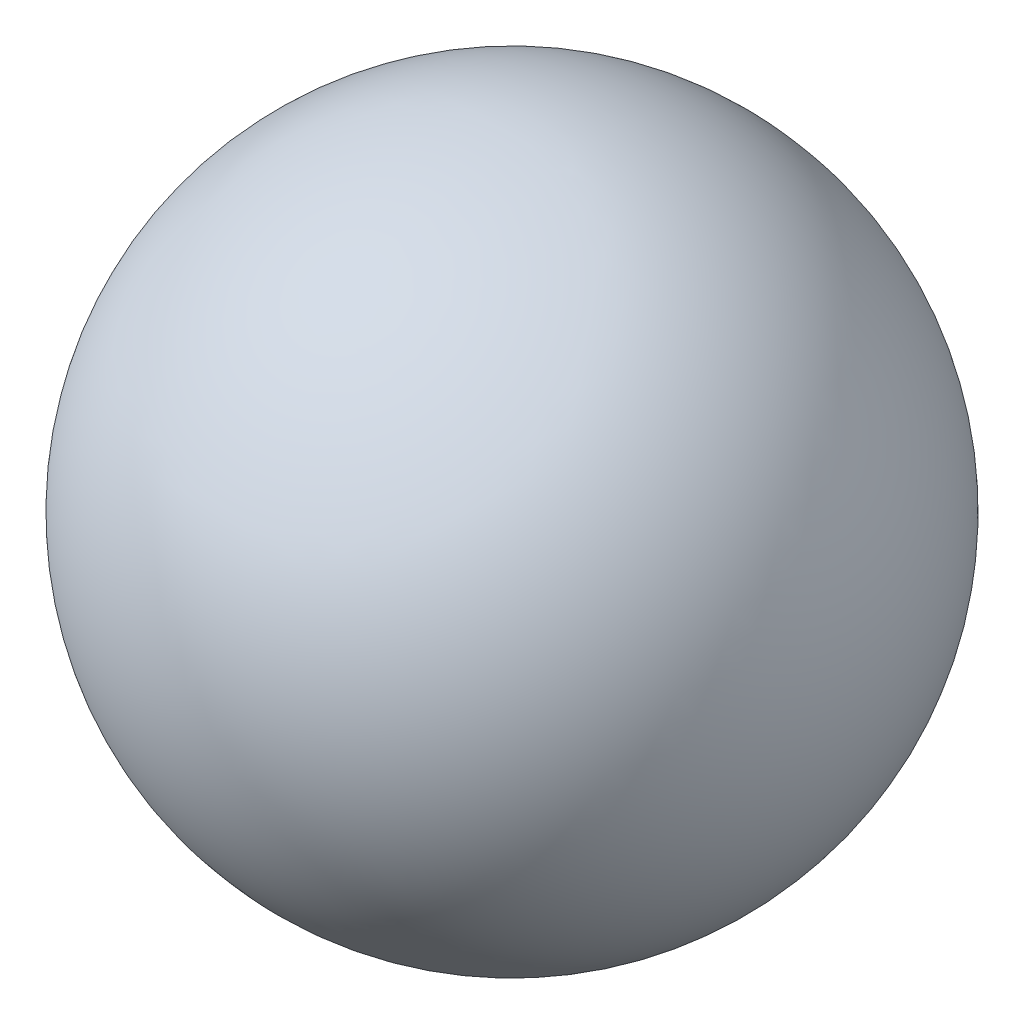
ISO-10303-21;
HEADER;
FILE_DESCRIPTION(('STEP AP214'),'2;1');
FILE_NAME('part.step','',(''),(''),'','','');
FILE_SCHEMA(('AUTOMOTIVE_DESIGN { 1 0 10303 214 1 1 1 1 }'));
ENDSEC;
DATA;
#1=APPLICATION_CONTEXT('core data for automotive mechanical design processes');
#2=APPLICATION_PROTOCOL_DEFINITION('international standard','automotive_design',2000,#1);
#3=PRODUCT_CONTEXT('',#1,'mechanical');
#4=PRODUCT('Part','Part','',(#3));
#5=PRODUCT_RELATED_PRODUCT_CATEGORY('part','',(#4));
#6=PRODUCT_DEFINITION_FORMATION('','',#4);
#7=PRODUCT_DEFINITION_CONTEXT('part definition',#1,'design');
#8=PRODUCT_DEFINITION('design','',#6,#7);
#9=PRODUCT_DEFINITION_SHAPE('','',#8);
#10=(LENGTH_UNIT() NAMED_UNIT(*) SI_UNIT(.MILLI.,.METRE.));
#11=(NAMED_UNIT(*) PLANE_ANGLE_UNIT() SI_UNIT($,.RADIAN.));
#12=(NAMED_UNIT(*) SI_UNIT($,.STERADIAN.) SOLID_ANGLE_UNIT());
#13=UNCERTAINTY_MEASURE_WITH_UNIT(LENGTH_MEASURE(1.E-05),#10,'distance_accuracy_value','');
#14=(GEOMETRIC_REPRESENTATION_CONTEXT(3) GLOBAL_UNCERTAINTY_ASSIGNED_CONTEXT((#13)) GLOBAL_UNIT_ASSIGNED_CONTEXT((#10,
#11,#12)) REPRESENTATION_CONTEXT('',''));
#15=CARTESIAN_POINT('',(0.,0.,0.));
#16=DIRECTION('',(0.,0.,1.));
#17=DIRECTION('',(1.,0.,0.));
#18=AXIS2_PLACEMENT_3D('',#15,#16,#17);
#19=CARTESIAN_POINT('',(64.16,36.5662485822867,-58.965330098444));
#20=DIRECTION('',(0.,0.52702028713499,-0.849852703089287));
#21=DIRECTION('',(0.173648177666935,0.836941530920705,0.519013664765254));
#22=AXIS2_PLACEMENT_3D('',#19,#20,#21);
#23=SPHERICAL_SURFACE('',#22,7.15);
#24=CARTESIAN_POINT('',(64.16,40.3344436353018,-65.0417769255324));
#25=VERTEX_POINT('',#24);
#26=VERTEX_LOOP('',#25);
#27=FACE_BOUND('',#26,.T.);
#28=CARTESIAN_POINT('',(64.16,32.7980535292716,-52.8888832713557));
#29=VERTEX_POINT('',#28);
#30=VERTEX_LOOP('',#29);
#31=FACE_BOUND('',#30,.T.);
#32=ADVANCED_FACE('F15',(#27,#31),#23,.T.);
#33=CLOSED_SHELL('',(#32));
#34=MANIFOLD_SOLID_BREP('B1',#33);
#35=ADVANCED_BREP_SHAPE_REPRESENTATION('',(#18,#34),#14);
#36=SHAPE_DEFINITION_REPRESENTATION(#9,#35);
ENDSEC;
END-ISO-10303-21;
